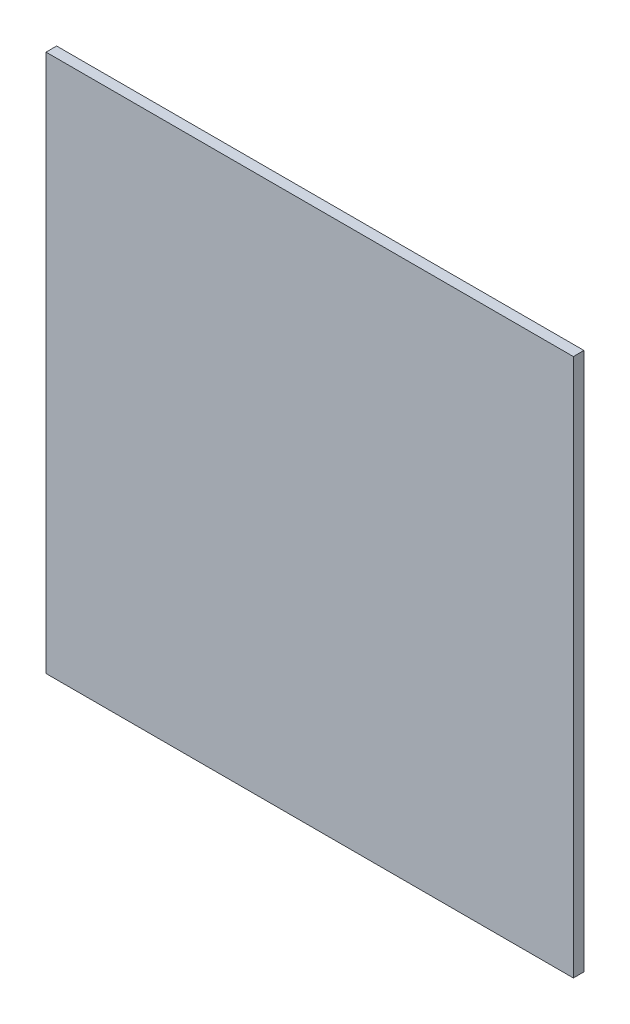
ISO-10303-21;
HEADER;
FILE_DESCRIPTION(('STEP AP214'),'2;1');
FILE_NAME('part.step','',(''),(''),'','','');
FILE_SCHEMA(('AUTOMOTIVE_DESIGN { 1 0 10303 214 1 1 1 1 }'));
ENDSEC;
DATA;
#1=APPLICATION_CONTEXT('core data for automotive mechanical design processes');
#2=APPLICATION_PROTOCOL_DEFINITION('international standard','automotive_design',2000,#1);
#3=PRODUCT_CONTEXT('',#1,'mechanical');
#4=PRODUCT('Part','Part','',(#3));
#5=PRODUCT_RELATED_PRODUCT_CATEGORY('part','',(#4));
#6=PRODUCT_DEFINITION_FORMATION('','',#4);
#7=PRODUCT_DEFINITION_CONTEXT('part definition',#1,'design');
#8=PRODUCT_DEFINITION('design','',#6,#7);
#9=PRODUCT_DEFINITION_SHAPE('','',#8);
#10=(LENGTH_UNIT() NAMED_UNIT(*) SI_UNIT(.MILLI.,.METRE.));
#11=(NAMED_UNIT(*) PLANE_ANGLE_UNIT() SI_UNIT($,.RADIAN.));
#12=(NAMED_UNIT(*) SI_UNIT($,.STERADIAN.) SOLID_ANGLE_UNIT());
#13=UNCERTAINTY_MEASURE_WITH_UNIT(LENGTH_MEASURE(1.E-05),#10,'distance_accuracy_value','');
#14=(GEOMETRIC_REPRESENTATION_CONTEXT(3) GLOBAL_UNCERTAINTY_ASSIGNED_CONTEXT((#13)) GLOBAL_UNIT_ASSIGNED_CONTEXT((#10,
#11,#12)) REPRESENTATION_CONTEXT('',''));
#15=CARTESIAN_POINT('',(0.,0.,0.));
#16=DIRECTION('',(0.,0.,1.));
#17=DIRECTION('',(1.,0.,0.));
#18=AXIS2_PLACEMENT_3D('',#15,#16,#17);
#19=CARTESIAN_POINT('',(0.24887174,0.254,0.));
#20=DIRECTION('',(0.9999999999875,4.9999999380845E-06,0.));
#21=DIRECTION('',(4.9999999380845E-06,-0.9999999999875,0.));
#22=AXIS2_PLACEMENT_3D('',#19,#20,#21);
#23=PLANE('',#22);
#24=DIRECTION('',(0.,0.,1.));
#25=VECTOR('',#24,1.);
#26=CARTESIAN_POINT('',(0.24887174,0.254,0.));
#27=LINE('',#26,#25);
#28=CARTESIAN_POINT('',(0.24887174,0.254,0.));
#29=VERTEX_POINT('',#28);
#30=CARTESIAN_POINT('',(0.24887174,0.254,0.00999998));
#31=VERTEX_POINT('',#30);
#32=EDGE_CURVE('E11',#29,#31,#27,.T.);
#33=ORIENTED_EDGE('',*,*,#32,.T.);
#34=DIRECTION('',(4.9999999380845E-06,-0.9999999999875,0.));
#35=VECTOR('',#34,1.);
#36=CARTESIAN_POINT('',(0.24887174,0.254,0.00999998));
#37=LINE('',#36,#35);
#38=CARTESIAN_POINT('',(0.24887428,-0.254,0.00999998));
#39=VERTEX_POINT('',#38);
#40=EDGE_CURVE('E25',#31,#39,#37,.T.);
#41=ORIENTED_EDGE('',*,*,#40,.T.);
#42=DIRECTION('',(0.,0.,1.));
#43=VECTOR('',#42,1.);
#44=CARTESIAN_POINT('',(0.24887428,-0.254,0.));
#45=LINE('',#44,#43);
#46=CARTESIAN_POINT('',(0.24887428,-0.254,0.));
#47=VERTEX_POINT('',#46);
#48=EDGE_CURVE('E73',#47,#39,#45,.T.);
#49=ORIENTED_EDGE('',*,*,#48,.F.);
#50=DIRECTION('',(4.9999999380845E-06,-0.9999999999875,0.));
#51=VECTOR('',#50,1.);
#52=CARTESIAN_POINT('',(0.24887174,0.254,0.));
#53=LINE('',#52,#51);
#54=EDGE_CURVE('E99',#29,#47,#53,.T.);
#55=ORIENTED_EDGE('',*,*,#54,.F.);
#56=EDGE_LOOP('',(#33,#41,#49,#55));
#57=FACE_BOUND('',#56,.T.);
#58=ADVANCED_FACE('F17',(#57),#23,.T.);
#59=CARTESIAN_POINT('',(9.492645752023E-07,3.142613362583E-07,0.));
#60=DIRECTION('',(0.,0.,-1.));
#61=DIRECTION('',(-1.,0.,0.));
#62=AXIS2_PLACEMENT_3D('',#59,#60,#61);
#63=PLANE('',#62);
#64=ORIENTED_EDGE('',*,*,#54,.T.);
#65=DIRECTION('',(-0.99999999998698,5.1030041324379E-06,0.));
#66=VECTOR('',#65,1.);
#67=CARTESIAN_POINT('',(0.24887428,-0.254,0.));
#68=LINE('',#67,#66);
#69=CARTESIAN_POINT('',(-0.24887174,-0.25399746,0.));
#70=VERTEX_POINT('',#69);
#71=EDGE_CURVE('E95',#47,#70,#68,.T.);
#72=ORIENTED_EDGE('',*,*,#71,.T.);
#73=DIRECTION('',(0.,1.,0.));
#74=VECTOR('',#73,1.);
#75=CARTESIAN_POINT('',(-0.24887174,-0.25399746,0.));
#76=LINE('',#75,#74);
#77=CARTESIAN_POINT('',(-0.24887174,0.254,0.));
#78=VERTEX_POINT('',#77);
#79=EDGE_CURVE('E68',#70,#78,#76,.T.);
#80=ORIENTED_EDGE('',*,*,#79,.T.);
#81=DIRECTION('',(1.,0.,0.));
#82=VECTOR('',#81,1.);
#83=CARTESIAN_POINT('',(-0.24887174,0.254,0.));
#84=LINE('',#83,#82);
#85=EDGE_CURVE('E87',#78,#29,#84,.T.);
#86=ORIENTED_EDGE('',*,*,#85,.T.);
#87=EDGE_LOOP('',(#64,#72,#80,#86));
#88=FACE_BOUND('',#87,.T.);
#89=ADVANCED_FACE('F112',(#88),#63,.T.);
#90=CARTESIAN_POINT('',(-0.24887174,0.254,0.));
#91=DIRECTION('',(0.,1.,0.));
#92=DIRECTION('',(1.,0.,0.));
#93=AXIS2_PLACEMENT_3D('',#90,#91,#92);
#94=PLANE('',#93);
#95=DIRECTION('',(0.,0.,1.));
#96=VECTOR('',#95,1.);
#97=CARTESIAN_POINT('',(-0.24887174,0.254,0.));
#98=LINE('',#97,#96);
#99=CARTESIAN_POINT('',(-0.24887174,0.254,0.00999998));
#100=VERTEX_POINT('',#99);
#101=EDGE_CURVE('E83',#78,#100,#98,.T.);
#102=ORIENTED_EDGE('',*,*,#101,.T.);
#103=DIRECTION('',(1.,0.,0.));
#104=VECTOR('',#103,1.);
#105=CARTESIAN_POINT('',(-0.24887174,0.254,0.00999998));
#106=LINE('',#105,#104);
#107=EDGE_CURVE('E60',#100,#31,#106,.T.);
#108=ORIENTED_EDGE('',*,*,#107,.T.);
#109=ORIENTED_EDGE('',*,*,#32,.F.);
#110=ORIENTED_EDGE('',*,*,#85,.F.);
#111=EDGE_LOOP('',(#102,#108,#109,#110));
#112=FACE_BOUND('',#111,.T.);
#113=ADVANCED_FACE('F119',(#112),#94,.T.);
#114=CARTESIAN_POINT('',(9.492645752023E-07,3.142613362583E-07,0.00999998));
#115=DIRECTION('',(0.,0.,-1.));
#116=DIRECTION('',(-1.,0.,0.));
#117=AXIS2_PLACEMENT_3D('',#114,#115,#116);
#118=PLANE('',#117);
#119=ORIENTED_EDGE('',*,*,#107,.F.);
#120=DIRECTION('',(0.,1.,0.));
#121=VECTOR('',#120,1.);
#122=CARTESIAN_POINT('',(-0.24887174,-0.25399746,0.00999998));
#123=LINE('',#122,#121);
#124=CARTESIAN_POINT('',(-0.24887174,-0.25399746,0.00999998));
#125=VERTEX_POINT('',#124);
#126=EDGE_CURVE('E54',#125,#100,#123,.T.);
#127=ORIENTED_EDGE('',*,*,#126,.F.);
#128=DIRECTION('',(-0.99999999998698,5.1030041324379E-06,0.));
#129=VECTOR('',#128,1.);
#130=CARTESIAN_POINT('',(0.24887428,-0.254,0.00999998));
#131=LINE('',#130,#129);
#132=EDGE_CURVE('E58',#39,#125,#131,.T.);
#133=ORIENTED_EDGE('',*,*,#132,.F.);
#134=ORIENTED_EDGE('',*,*,#40,.F.);
#135=EDGE_LOOP('',(#119,#127,#133,#134));
#136=FACE_BOUND('',#135,.T.);
#137=ADVANCED_FACE('F56',(#136),#118,.F.);
#138=CARTESIAN_POINT('',(0.24887428,-0.254,0.));
#139=DIRECTION('',(-5.1030041324379E-06,-0.99999999998698,0.));
#140=DIRECTION('',(-0.99999999998698,5.1030041324379E-06,0.));
#141=AXIS2_PLACEMENT_3D('',#138,#139,#140);
#142=PLANE('',#141);
#143=ORIENTED_EDGE('',*,*,#48,.T.);
#144=ORIENTED_EDGE('',*,*,#132,.T.);
#145=DIRECTION('',(0.,0.,1.));
#146=VECTOR('',#145,1.);
#147=CARTESIAN_POINT('',(-0.24887174,-0.25399746,0.));
#148=LINE('',#147,#146);
#149=EDGE_CURVE('E66',#70,#125,#148,.T.);
#150=ORIENTED_EDGE('',*,*,#149,.F.);
#151=ORIENTED_EDGE('',*,*,#71,.F.);
#152=EDGE_LOOP('',(#143,#144,#150,#151));
#153=FACE_BOUND('',#152,.T.);
#154=ADVANCED_FACE('F72',(#153),#142,.T.);
#155=CARTESIAN_POINT('',(-0.24887174,-0.25399746,0.));
#156=DIRECTION('',(-1.,0.,0.));
#157=DIRECTION('',(0.,1.,0.));
#158=AXIS2_PLACEMENT_3D('',#155,#156,#157);
#159=PLANE('',#158);
#160=ORIENTED_EDGE('',*,*,#149,.T.);
#161=ORIENTED_EDGE('',*,*,#126,.T.);
#162=ORIENTED_EDGE('',*,*,#101,.F.);
#163=ORIENTED_EDGE('',*,*,#79,.F.);
#164=EDGE_LOOP('',(#160,#161,#162,#163));
#165=FACE_BOUND('',#164,.T.);
#166=ADVANCED_FACE('F67',(#165),#159,.T.);
#167=CLOSED_SHELL('',(#58,#89,#113,#137,#154,#166));
#168=MANIFOLD_SOLID_BREP('B1',#167);
#169=ADVANCED_BREP_SHAPE_REPRESENTATION('',(#18,#168),#14);
#170=SHAPE_DEFINITION_REPRESENTATION(#9,#169);
ENDSEC;
END-ISO-10303-21;
